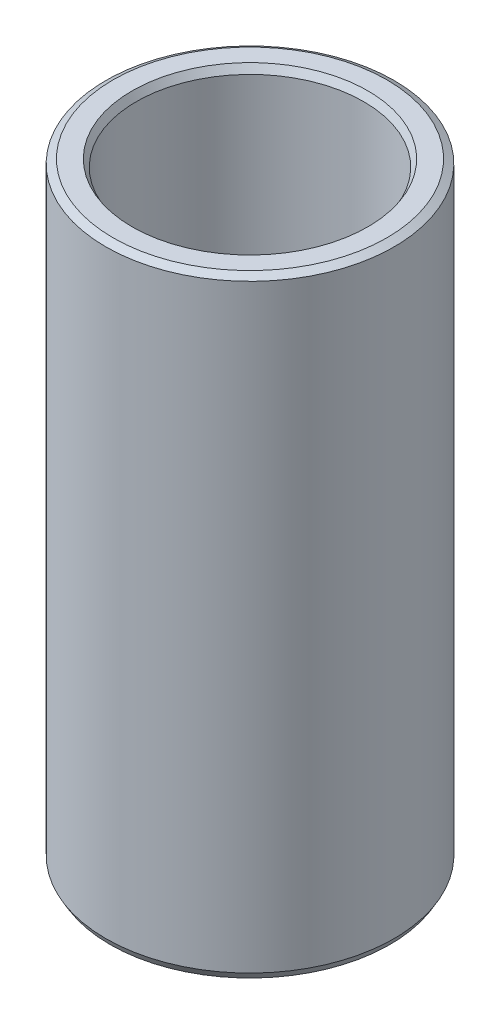
ISO-10303-21;
HEADER;
FILE_DESCRIPTION(('STEP AP214'),'2;1');
FILE_NAME('part.step','',(''),(''),'','','');
FILE_SCHEMA(('AUTOMOTIVE_DESIGN { 1 0 10303 214 1 1 1 1 }'));
ENDSEC;
DATA;
#1=APPLICATION_CONTEXT('core data for automotive mechanical design processes');
#2=APPLICATION_PROTOCOL_DEFINITION('international standard','automotive_design',2000,#1);
#3=PRODUCT_CONTEXT('',#1,'mechanical');
#4=PRODUCT('Part','Part','',(#3));
#5=PRODUCT_RELATED_PRODUCT_CATEGORY('part','',(#4));
#6=PRODUCT_DEFINITION_FORMATION('','',#4);
#7=PRODUCT_DEFINITION_CONTEXT('part definition',#1,'design');
#8=PRODUCT_DEFINITION('design','',#6,#7);
#9=PRODUCT_DEFINITION_SHAPE('','',#8);
#10=(LENGTH_UNIT() NAMED_UNIT(*) SI_UNIT(.MILLI.,.METRE.));
#11=(NAMED_UNIT(*) PLANE_ANGLE_UNIT() SI_UNIT($,.RADIAN.));
#12=(NAMED_UNIT(*) SI_UNIT($,.STERADIAN.) SOLID_ANGLE_UNIT());
#13=UNCERTAINTY_MEASURE_WITH_UNIT(LENGTH_MEASURE(1.E-05),#10,'distance_accuracy_value','');
#14=(GEOMETRIC_REPRESENTATION_CONTEXT(3) GLOBAL_UNCERTAINTY_ASSIGNED_CONTEXT((#13)) GLOBAL_UNIT_ASSIGNED_CONTEXT((#10,
#11,#12)) REPRESENTATION_CONTEXT('',''));
#15=CARTESIAN_POINT('',(0.,0.,0.));
#16=DIRECTION('',(0.,0.,1.));
#17=DIRECTION('',(1.,0.,0.));
#18=AXIS2_PLACEMENT_3D('',#15,#16,#17);
#19=CARTESIAN_POINT('',(0.,211.772217321393,0.));
#20=DIRECTION('',(0.,-1.,0.));
#21=DIRECTION('',(0.,0.,-1.));
#22=AXIS2_PLACEMENT_3D('',#19,#20,#21);
#23=CYLINDRICAL_SURFACE('',#22,50.);
#24=CARTESIAN_POINT('',(0.,2.51806170558511,0.));
#25=DIRECTION('',(0.,1.,0.));
#26=DIRECTION('',(0.,0.,1.));
#27=AXIS2_PLACEMENT_3D('',#24,#25,#26);
#28=CIRCLE('',#27,50.);
#29=CARTESIAN_POINT('',(0.,2.51806170558511,-50.));
#30=VERTEX_POINT('',#29);
#31=EDGE_CURVE('E10',#30,#30,#28,.T.);
#32=CARTESIAN_POINT('',(0.,210.318413717838,0.));
#33=DIRECTION('',(0.,1.,0.));
#34=DIRECTION('',(0.,0.,1.));
#35=AXIS2_PLACEMENT_3D('',#32,#33,#34);
#36=CIRCLE('',#35,50.);
#37=CARTESIAN_POINT('',(0.,210.318413717838,-50.));
#38=VERTEX_POINT('',#37);
#39=EDGE_CURVE('E50',#38,#38,#36,.F.);
#40=CARTESIAN_POINT('',(0.,2.51806170558511,-50.));
#41=CARTESIAN_POINT('',(0.,4.68264870571274,-50.));
#42=CARTESIAN_POINT('',(0.,6.84723570584037,-50.));
#43=CARTESIAN_POINT('',(0.,11.1764097060956,-50.));
#44=CARTESIAN_POINT('',(0.,13.3409967062233,-50.));
#45=CARTESIAN_POINT('',(0.,17.6701707064785,-50.));
#46=CARTESIAN_POINT('',(0.,19.8347577066062,-50.));
#47=CARTESIAN_POINT('',(0.,24.1639317068614,-50.));
#48=CARTESIAN_POINT('',(0.,26.3285187069891,-50.));
#49=CARTESIAN_POINT('',(0.,30.6576927072444,-50.));
#50=CARTESIAN_POINT('',(0.,32.822279707372,-50.));
#51=CARTESIAN_POINT('',(0.,37.1514537076273,-50.));
#52=CARTESIAN_POINT('',(0.,39.3160407077549,-50.));
#53=CARTESIAN_POINT('',(0.,43.6452147080102,-50.));
#54=CARTESIAN_POINT('',(0.,45.8098017081378,-50.));
#55=CARTESIAN_POINT('',(0.,50.1389757083931,-50.));
#56=CARTESIAN_POINT('',(0.,52.3035627085207,-50.));
#57=CARTESIAN_POINT('',(0.,56.632736708776,-50.));
#58=CARTESIAN_POINT('',(0.,58.7973237089036,-50.));
#59=CARTESIAN_POINT('',(0.,63.1264977091589,-50.));
#60=CARTESIAN_POINT('',(0.,65.2910847092865,-50.));
#61=CARTESIAN_POINT('',(0.,69.6202587095418,-50.));
#62=CARTESIAN_POINT('',(0.,71.7848457096694,-50.));
#63=CARTESIAN_POINT('',(0.,76.1140197099247,-50.));
#64=CARTESIAN_POINT('',(0.,78.2786067100523,-50.));
#65=CARTESIAN_POINT('',(0.,82.6077807103075,-50.));
#66=CARTESIAN_POINT('',(0.,84.7723677104352,-50.));
#67=CARTESIAN_POINT('',(0.,89.1015417106904,-50.));
#68=CARTESIAN_POINT('',(0.,91.2661287108181,-50.));
#69=CARTESIAN_POINT('',(0.,95.5953027110733,-50.));
#70=CARTESIAN_POINT('',(0.,97.759889711201,-50.));
#71=CARTESIAN_POINT('',(0.,102.089063711456,-50.));
#72=CARTESIAN_POINT('',(0.,104.253650711584,-50.));
#73=CARTESIAN_POINT('',(0.,108.582824711839,-50.));
#74=CARTESIAN_POINT('',(0.,110.747411711967,-50.));
#75=CARTESIAN_POINT('',(0.,115.076585712222,-50.));
#76=CARTESIAN_POINT('',(0.,117.24117271235,-50.));
#77=CARTESIAN_POINT('',(0.,121.570346712605,-50.));
#78=CARTESIAN_POINT('',(0.,123.734933712733,-50.));
#79=CARTESIAN_POINT('',(0.,128.064107712988,-50.));
#80=CARTESIAN_POINT('',(0.,130.228694713115,-50.));
#81=CARTESIAN_POINT('',(0.,134.557868713371,-50.));
#82=CARTESIAN_POINT('',(0.,136.722455713498,-50.));
#83=CARTESIAN_POINT('',(0.,141.051629713754,-50.));
#84=CARTESIAN_POINT('',(0.,143.216216713881,-50.));
#85=CARTESIAN_POINT('',(0.,147.545390714137,-50.));
#86=CARTESIAN_POINT('',(0.,149.709977714264,-50.));
#87=CARTESIAN_POINT('',(0.,154.039151714519,-50.));
#88=CARTESIAN_POINT('',(0.,156.203738714647,-50.));
#89=CARTESIAN_POINT('',(0.,160.532912714902,-50.));
#90=CARTESIAN_POINT('',(0.,162.69749971503,-50.));
#91=CARTESIAN_POINT('',(0.,167.026673715285,-50.));
#92=CARTESIAN_POINT('',(0.,169.191260715413,-50.));
#93=CARTESIAN_POINT('',(0.,173.520434715668,-50.));
#94=CARTESIAN_POINT('',(0.,175.685021715796,-50.));
#95=CARTESIAN_POINT('',(0.,180.014195716051,-50.));
#96=CARTESIAN_POINT('',(0.,182.178782716179,-50.));
#97=CARTESIAN_POINT('',(0.,186.507956716434,-50.));
#98=CARTESIAN_POINT('',(0.,188.672543716562,-50.));
#99=CARTESIAN_POINT('',(0.,193.001717716817,-50.));
#100=CARTESIAN_POINT('',(0.,195.166304716944,-50.));
#101=CARTESIAN_POINT('',(0.,199.4954787172,-50.));
#102=CARTESIAN_POINT('',(0.,201.660065717327,-50.));
#103=CARTESIAN_POINT('',(0.,205.989239717583,-50.));
#104=CARTESIAN_POINT('',(0.,208.15382671771,-50.));
#105=CARTESIAN_POINT('',(0.,210.318413717838,-50.));
#106=B_SPLINE_CURVE_WITH_KNOTS('',3,(#40,#41,#42,#43,#44,#45,#46,#47,#48,#49,#50,#51,#52,#53,
#54,#55,#56,#57,#58,#59,#60,#61,#62,#63,#64,#65,#66,#67,#68,#69,#70,#71,#72,#73,#74,#75,#76,#77,
#78,#79,#80,#81,#82,#83,#84,#85,#86,#87,#88,#89,#90,#91,#92,#93,#94,#95,#96,#97,#98,#99,#100,
#101,#102,#103,#104,#105),.UNSPECIFIED.,.F.,.F.,(4,2,2,2,2,2,2,2,2,2,2,2,2,2,2,2,2,2,2,2,2,2,2,
2,2,2,2,2,2,2,2,2,4),(0.,6.4937610003829,12.9875220007658,19.4812830011487,25.9750440015316,
32.4688050019145,38.9625660022974,45.4563270026803,51.9500880030632,58.4438490034461,
64.937610003829,71.4313710042119,77.9251320045948,84.4188930049777,90.9126540053606,
97.4064150057435,103.900176006126,110.393937006509,116.887698006892,123.381459007275,
129.875220007658,136.368981008041,142.862742008424,149.356503008807,155.85026400919,
162.344025009572,168.837786009955,175.331547010338,181.825308010721,188.319069011104,
194.812830011487,201.30659101187,207.800352012253),.UNSPECIFIED.);
#107=EDGE_CURVE('BSEAM39',#30,#38,#106,.T.);
#108=ORIENTED_EDGE('',*,*,#31,.T.);
#109=ORIENTED_EDGE('',*,*,#39,.T.);
#110=ORIENTED_EDGE('',*,*,#107,.T.);
#111=ORIENTED_EDGE('',*,*,#107,.F.);
#112=EDGE_LOOP('',(#108,#110,#109,#111));
#113=FACE_BOUND('',#112,.T.);
#114=ADVANCED_FACE('F39',(#113),#23,.T.);
#115=CARTESIAN_POINT('',(0.,211.772217321393,0.));
#116=DIRECTION('',(0.,1.,0.));
#117=DIRECTION('',(0.,0.,1.));
#118=AXIS2_PLACEMENT_3D('',#115,#116,#117);
#119=PLANE('',#118);
#120=CARTESIAN_POINT('',(0.,211.772217321393,0.));
#121=DIRECTION('',(0.,1.,0.));
#122=DIRECTION('',(0.,0.,1.));
#123=AXIS2_PLACEMENT_3D('',#120,#121,#122);
#124=CIRCLE('',#123,40.8874798064744);
#125=CARTESIAN_POINT('',(0.,211.772217321393,40.8874798064744));
#126=VERTEX_POINT('',#125);
#127=EDGE_CURVE('E58',#126,#126,#124,.F.);
#128=ORIENTED_EDGE('',*,*,#127,.T.);
#129=EDGE_LOOP('',(#128));
#130=FACE_BOUND('',#129,.T.);
#131=CARTESIAN_POINT('',(0.,211.772217321393,0.));
#132=DIRECTION('',(0.,1.,0.));
#133=DIRECTION('',(0.,0.,1.));
#134=AXIS2_PLACEMENT_3D('',#131,#132,#133);
#135=CIRCLE('',#134,47.4819382944156);
#136=CARTESIAN_POINT('',(0.,211.772217321393,47.4819382944156));
#137=VERTEX_POINT('',#136);
#138=EDGE_CURVE('E61',#137,#137,#135,.T.);
#139=ORIENTED_EDGE('',*,*,#138,.T.);
#140=EDGE_LOOP('',(#139));
#141=FACE_BOUND('',#140,.T.);
#142=ADVANCED_FACE('F88',(#130,#141),#119,.T.);
#143=CARTESIAN_POINT('',(0.,0.,0.));
#144=DIRECTION('',(0.,1.,0.));
#145=DIRECTION('',(0.,0.,1.));
#146=AXIS2_PLACEMENT_3D('',#143,#144,#145);
#147=PLANE('',#146);
#148=CARTESIAN_POINT('',(0.,0.,0.));
#149=DIRECTION('',(0.,1.,0.));
#150=DIRECTION('',(0.,0.,1.));
#151=AXIS2_PLACEMENT_3D('',#148,#149,#150);
#152=CIRCLE('',#151,41.9517379085034);
#153=CARTESIAN_POINT('',(0.,0.,41.9517379085034));
#154=VERTEX_POINT('',#153);
#155=EDGE_CURVE('E51',#154,#154,#152,.T.);
#156=ORIENTED_EDGE('',*,*,#155,.T.);
#157=EDGE_LOOP('',(#156));
#158=FACE_BOUND('',#157,.T.);
#159=CARTESIAN_POINT('',(0.,0.,0.));
#160=DIRECTION('',(0.,1.,0.));
#161=DIRECTION('',(0.,0.,1.));
#162=AXIS2_PLACEMENT_3D('',#159,#160,#161);
#163=CIRCLE('',#162,48.5461963964444);
#164=CARTESIAN_POINT('',(0.,0.,48.5461963964444));
#165=VERTEX_POINT('',#164);
#166=EDGE_CURVE('E54',#165,#165,#163,.F.);
#167=ORIENTED_EDGE('',*,*,#166,.T.);
#168=EDGE_LOOP('',(#167));
#169=FACE_BOUND('',#168,.T.);
#170=ADVANCED_FACE('F83',(#158,#169),#147,.F.);
#171=CARTESIAN_POINT('',(0.,211.772217321393,0.));
#172=DIRECTION('',(0.,-1.,0.));
#173=DIRECTION('',(0.,0.,-1.));
#174=AXIS2_PLACEMENT_3D('',#171,#172,#173);
#175=CYLINDRICAL_SURFACE('',#174,39.4336762029189);
#176=CARTESIAN_POINT('',(0.,209.254155615808,0.));
#177=DIRECTION('',(0.,1.,0.));
#178=DIRECTION('',(0.,0.,1.));
#179=AXIS2_PLACEMENT_3D('',#176,#177,#178);
#180=CIRCLE('',#179,39.4336762029189);
#181=CARTESIAN_POINT('',(0.,209.254155615808,-39.4336762029189));
#182=VERTEX_POINT('',#181);
#183=EDGE_CURVE('E67',#182,#182,#180,.T.);
#184=CARTESIAN_POINT('',(0.,1.45380360355532,0.));
#185=DIRECTION('',(0.,1.,0.));
#186=DIRECTION('',(0.,0.,1.));
#187=AXIS2_PLACEMENT_3D('',#184,#185,#186);
#188=CIRCLE('',#187,39.4336762029189);
#189=CARTESIAN_POINT('',(0.,1.45380360355529,-39.4336762029189));
#190=VERTEX_POINT('',#189);
#191=EDGE_CURVE('E69',#190,#190,#188,.F.);
#192=CARTESIAN_POINT('',(0.,209.254155615808,-39.4336762029189));
#193=CARTESIAN_POINT('',(0.,207.089568615681,-39.4336762029189));
#194=CARTESIAN_POINT('',(0.,204.924981615553,-39.4336762029189));
#195=CARTESIAN_POINT('',(0.,200.595807615298,-39.4336762029189));
#196=CARTESIAN_POINT('',(0.,198.43122061517,-39.4336762029189));
#197=CARTESIAN_POINT('',(0.,194.102046614915,-39.4336762029189));
#198=CARTESIAN_POINT('',(0.,191.937459614787,-39.4336762029189));
#199=CARTESIAN_POINT('',(0.,187.608285614532,-39.4336762029189));
#200=CARTESIAN_POINT('',(0.,185.443698614404,-39.4336762029189));
#201=CARTESIAN_POINT('',(0.,181.114524614149,-39.4336762029189));
#202=CARTESIAN_POINT('',(0.,178.949937614021,-39.4336762029189));
#203=CARTESIAN_POINT('',(0.,174.620763613766,-39.4336762029189));
#204=CARTESIAN_POINT('',(0.,172.456176613639,-39.4336762029189));
#205=CARTESIAN_POINT('',(0.,168.127002613383,-39.4336762029189));
#206=CARTESIAN_POINT('',(0.,165.962415613256,-39.4336762029189));
#207=CARTESIAN_POINT('',(0.,161.633241613,-39.4336762029189));
#208=CARTESIAN_POINT('',(0.,159.468654612873,-39.4336762029189));
#209=CARTESIAN_POINT('',(0.,155.139480612617,-39.4336762029189));
#210=CARTESIAN_POINT('',(0.,152.97489361249,-39.4336762029189));
#211=CARTESIAN_POINT('',(0.,148.645719612235,-39.4336762029189));
#212=CARTESIAN_POINT('',(0.,146.481132612107,-39.4336762029189));
#213=CARTESIAN_POINT('',(0.,142.151958611852,-39.4336762029189));
#214=CARTESIAN_POINT('',(0.,139.987371611724,-39.4336762029189));
#215=CARTESIAN_POINT('',(0.,135.658197611469,-39.4336762029189));
#216=CARTESIAN_POINT('',(0.,133.493610611341,-39.4336762029189));
#217=CARTESIAN_POINT('',(0.,129.164436611086,-39.4336762029189));
#218=CARTESIAN_POINT('',(0.,126.999849610958,-39.4336762029189));
#219=CARTESIAN_POINT('',(0.,122.670675610703,-39.4336762029189));
#220=CARTESIAN_POINT('',(0.,120.506088610575,-39.4336762029189));
#221=CARTESIAN_POINT('',(0.,116.17691461032,-39.4336762029189));
#222=CARTESIAN_POINT('',(0.,114.012327610192,-39.4336762029189));
#223=CARTESIAN_POINT('',(0.,109.683153609937,-39.4336762029189));
#224=CARTESIAN_POINT('',(0.,107.518566609809,-39.4336762029189));
#225=CARTESIAN_POINT('',(0.,103.189392609554,-39.4336762029189));
#226=CARTESIAN_POINT('',(0.,101.024805609427,-39.4336762029189));
#227=CARTESIAN_POINT('',(0.,96.6956316091713,-39.4336762029189));
#228=CARTESIAN_POINT('',(0.,94.5310446090436,-39.4336762029189));
#229=CARTESIAN_POINT('',(0.,90.2018706087884,-39.4336762029189));
#230=CARTESIAN_POINT('',(0.,88.0372836086607,-39.4336762029189));
#231=CARTESIAN_POINT('',(0.,83.7081096084055,-39.4336762029189));
#232=CARTESIAN_POINT('',(0.,81.5435226082778,-39.4336762029189));
#233=CARTESIAN_POINT('',(0.,77.2143486080225,-39.4336762029189));
#234=CARTESIAN_POINT('',(0.,75.0497616078949,-39.4336762029189));
#235=CARTESIAN_POINT('',(0.,70.7205876076396,-39.4336762029189));
#236=CARTESIAN_POINT('',(0.,68.556000607512,-39.4336762029189));
#237=CARTESIAN_POINT('',(0.,64.2268266072567,-39.4336762029189));
#238=CARTESIAN_POINT('',(0.,62.0622396071291,-39.4336762029189));
#239=CARTESIAN_POINT('',(0.,57.7330656068738,-39.4336762029189));
#240=CARTESIAN_POINT('',(0.,55.5684786067462,-39.4336762029189));
#241=CARTESIAN_POINT('',(0.,51.2393046064909,-39.4336762029189));
#242=CARTESIAN_POINT('',(0.,49.0747176063633,-39.4336762029189));
#243=CARTESIAN_POINT('',(0.,44.745543606108,-39.4336762029189));
#244=CARTESIAN_POINT('',(0.,42.5809566059804,-39.4336762029189));
#245=CARTESIAN_POINT('',(0.,38.2517826057251,-39.4336762029189));
#246=CARTESIAN_POINT('',(0.,36.0871956055975,-39.4336762029189));
#247=CARTESIAN_POINT('',(0.,31.7580216053422,-39.4336762029189));
#248=CARTESIAN_POINT('',(0.,29.5934346052146,-39.4336762029189));
#249=CARTESIAN_POINT('',(0.,25.2642606049593,-39.4336762029189));
#250=CARTESIAN_POINT('',(0.,23.0996736048317,-39.4336762029189));
#251=CARTESIAN_POINT('',(0.,18.7704996045764,-39.4336762029189));
#252=CARTESIAN_POINT('',(0.,16.6059126044487,-39.4336762029189));
#253=CARTESIAN_POINT('',(0.,12.2767386041935,-39.4336762029189));
#254=CARTESIAN_POINT('',(0.,10.1121516040658,-39.4336762029189));
#255=CARTESIAN_POINT('',(0.,5.78297760381056,-39.4336762029189));
#256=CARTESIAN_POINT('',(0.,3.61839060368293,-39.4336762029189));
#257=CARTESIAN_POINT('',(0.,1.45380360355529,-39.4336762029189));
#258=B_SPLINE_CURVE_WITH_KNOTS('',3,(#192,#193,#194,#195,#196,#197,#198,#199,#200,#201,#202,
#203,#204,#205,#206,#207,#208,#209,#210,#211,#212,#213,#214,#215,#216,#217,#218,#219,#220,#221,
#222,#223,#224,#225,#226,#227,#228,#229,#230,#231,#232,#233,#234,#235,#236,#237,#238,#239,#240,
#241,#242,#243,#244,#245,#246,#247,#248,#249,#250,#251,#252,#253,#254,#255,#256,#257),
.UNSPECIFIED.,.F.,.F.,(4,2,2,2,2,2,2,2,2,2,2,2,2,2,2,2,2,2,2,2,2,2,2,2,2,2,2,2,2,2,2,2,4),(0.,
6.4937610003829,12.9875220007658,19.4812830011487,25.9750440015316,32.4688050019145,
38.9625660022974,45.4563270026803,51.9500880030633,58.4438490034462,64.9376100038291,
71.431371004212,77.9251320045949,84.4188930049778,90.9126540053607,97.4064150057436,
103.900176006127,110.393937006509,116.887698006892,123.381459007275,129.875220007658,
136.368981008041,142.862742008424,149.356503008807,155.85026400919,162.344025009573,
168.837786009956,175.331547010338,181.825308010721,188.319069011104,194.812830011487,
201.30659101187,207.800352012253),.UNSPECIFIED.);
#259=EDGE_CURVE('BSEAM71',#182,#190,#258,.T.);
#260=ORIENTED_EDGE('',*,*,#183,.T.);
#261=ORIENTED_EDGE('',*,*,#191,.T.);
#262=ORIENTED_EDGE('',*,*,#259,.T.);
#263=ORIENTED_EDGE('',*,*,#259,.F.);
#264=EDGE_LOOP('',(#260,#262,#261,#263));
#265=FACE_BOUND('',#264,.T.);
#266=ADVANCED_FACE('F71',(#265),#175,.F.);
#267=CARTESIAN_POINT('',(0.,209.254155615808,0.));
#268=DIRECTION('',(0.,1.,0.));
#269=DIRECTION('',(0.,0.,1.));
#270=AXIS2_PLACEMENT_3D('',#267,#268,#269);
#271=CONICAL_SURFACE('',#270,39.4336762029189,0.523598775598296);
#272=ORIENTED_EDGE('',*,*,#127,.F.);
#273=EDGE_LOOP('',(#272));
#274=FACE_BOUND('',#273,.T.);
#275=ORIENTED_EDGE('',*,*,#183,.F.);
#276=EDGE_LOOP('',(#275));
#277=FACE_BOUND('',#276,.T.);
#278=ADVANCED_FACE('F77',(#274,#277),#271,.F.);
#279=CARTESIAN_POINT('',(0.,0.,0.));
#280=DIRECTION('',(0.,-1.,0.));
#281=DIRECTION('',(0.,0.,-1.));
#282=AXIS2_PLACEMENT_3D('',#279,#280,#281);
#283=CONICAL_SURFACE('',#282,41.9517379085034,1.0471975511966);
#284=ORIENTED_EDGE('',*,*,#191,.F.);
#285=EDGE_LOOP('',(#284));
#286=FACE_BOUND('',#285,.T.);
#287=ORIENTED_EDGE('',*,*,#155,.F.);
#288=EDGE_LOOP('',(#287));
#289=FACE_BOUND('',#288,.T.);
#290=ADVANCED_FACE('F73',(#286,#289),#283,.F.);
#291=CARTESIAN_POINT('',(0.,2.51806170558511,0.));
#292=DIRECTION('',(0.,1.,0.));
#293=DIRECTION('',(0.,0.,1.));
#294=AXIS2_PLACEMENT_3D('',#291,#292,#293);
#295=CONICAL_SURFACE('',#294,50.,0.523598775598296);
#296=ORIENTED_EDGE('',*,*,#166,.F.);
#297=EDGE_LOOP('',(#296));
#298=FACE_BOUND('',#297,.T.);
#299=ORIENTED_EDGE('',*,*,#31,.F.);
#300=EDGE_LOOP('',(#299));
#301=FACE_BOUND('',#300,.T.);
#302=ADVANCED_FACE('F76',(#298,#301),#295,.T.);
#303=CARTESIAN_POINT('',(0.,211.772217321393,0.));
#304=DIRECTION('',(0.,-1.,0.));
#305=DIRECTION('',(0.,0.,-1.));
#306=AXIS2_PLACEMENT_3D('',#303,#304,#305);
#307=CONICAL_SURFACE('',#306,47.4819382944156,1.0471975511966);
#308=ORIENTED_EDGE('',*,*,#39,.F.);
#309=EDGE_LOOP('',(#308));
#310=FACE_BOUND('',#309,.T.);
#311=ORIENTED_EDGE('',*,*,#138,.F.);
#312=EDGE_LOOP('',(#311));
#313=FACE_BOUND('',#312,.T.);
#314=ADVANCED_FACE('F45',(#310,#313),#307,.T.);
#315=CLOSED_SHELL('',(#114,#142,#170,#266,#278,#290,#302,#314));
#316=MANIFOLD_SOLID_BREP('B2',#315);
#317=ADVANCED_BREP_SHAPE_REPRESENTATION('',(#18,#316),#14);
#318=SHAPE_DEFINITION_REPRESENTATION(#9,#317);
ENDSEC;
END-ISO-10303-21;
